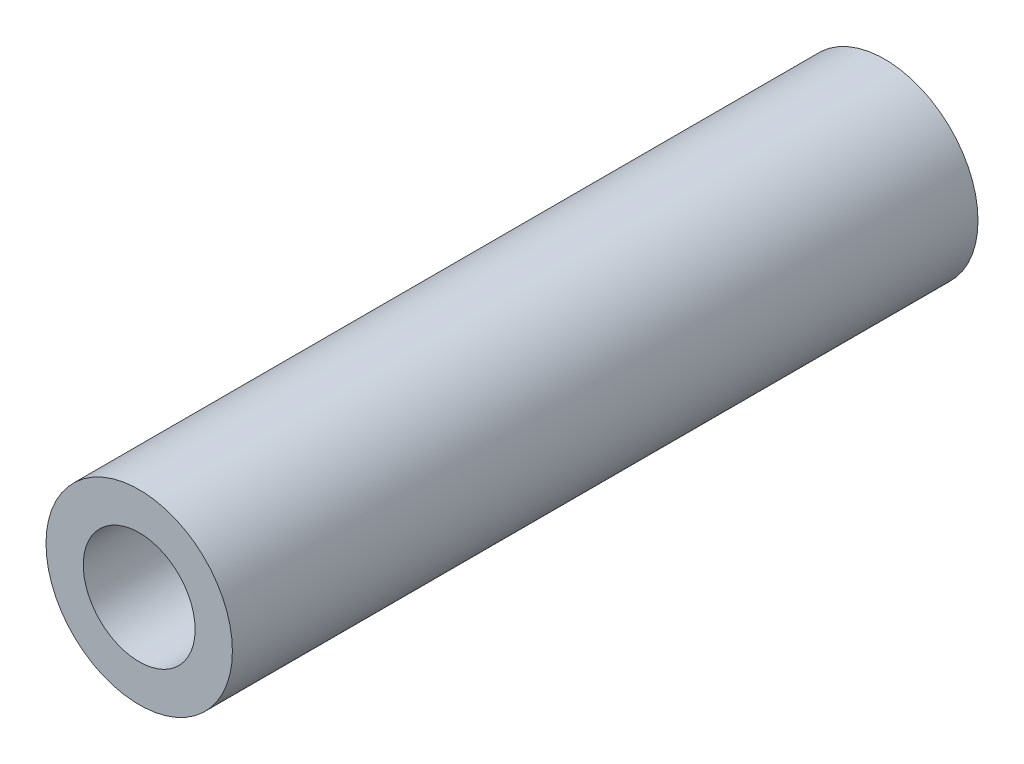
ISO-10303-21;
HEADER;
FILE_DESCRIPTION(('STEP AP214'),'2;1');
FILE_NAME('part.step','',(''),(''),'','','');
FILE_SCHEMA(('AUTOMOTIVE_DESIGN { 1 0 10303 214 1 1 1 1 }'));
ENDSEC;
DATA;
#1=APPLICATION_CONTEXT('core data for automotive mechanical design processes');
#2=APPLICATION_PROTOCOL_DEFINITION('international standard','automotive_design',2000,#1);
#3=PRODUCT_CONTEXT('',#1,'mechanical');
#4=PRODUCT('Part','Part','',(#3));
#5=PRODUCT_RELATED_PRODUCT_CATEGORY('part','',(#4));
#6=PRODUCT_DEFINITION_FORMATION('','',#4);
#7=PRODUCT_DEFINITION_CONTEXT('part definition',#1,'design');
#8=PRODUCT_DEFINITION('design','',#6,#7);
#9=PRODUCT_DEFINITION_SHAPE('','',#8);
#10=(LENGTH_UNIT() NAMED_UNIT(*) SI_UNIT(.MILLI.,.METRE.));
#11=(NAMED_UNIT(*) PLANE_ANGLE_UNIT() SI_UNIT($,.RADIAN.));
#12=(NAMED_UNIT(*) SI_UNIT($,.STERADIAN.) SOLID_ANGLE_UNIT());
#13=UNCERTAINTY_MEASURE_WITH_UNIT(LENGTH_MEASURE(1.E-05),#10,'distance_accuracy_value','');
#14=(GEOMETRIC_REPRESENTATION_CONTEXT(3) GLOBAL_UNCERTAINTY_ASSIGNED_CONTEXT((#13)) GLOBAL_UNIT_ASSIGNED_CONTEXT((#10,
#11,#12)) REPRESENTATION_CONTEXT('',''));
#15=CARTESIAN_POINT('',(0.,0.,0.));
#16=DIRECTION('',(0.,0.,1.));
#17=DIRECTION('',(1.,0.,0.));
#18=AXIS2_PLACEMENT_3D('',#15,#16,#17);
#19=CARTESIAN_POINT('',(0.,0.,20.));
#20=DIRECTION('',(0.,0.,1.));
#21=DIRECTION('',(1.,0.,0.));
#22=AXIS2_PLACEMENT_3D('',#19,#20,#21);
#23=PLANE('',#22);
#24=CARTESIAN_POINT('',(0.,0.,20.));
#25=DIRECTION('',(0.,0.,1.));
#26=DIRECTION('',(1.,0.,0.));
#27=AXIS2_PLACEMENT_3D('',#24,#25,#26);
#28=CIRCLE('',#27,2.5);
#29=CARTESIAN_POINT('',(2.5,0.,20.));
#30=VERTEX_POINT('',#29);
#31=EDGE_CURVE('E10',#30,#30,#28,.T.);
#32=ORIENTED_EDGE('',*,*,#31,.T.);
#33=EDGE_LOOP('',(#32));
#34=FACE_BOUND('',#33,.T.);
#35=CARTESIAN_POINT('',(0.,0.,20.));
#36=DIRECTION('',(0.,0.,1.));
#37=DIRECTION('',(1.,0.,0.));
#38=AXIS2_PLACEMENT_3D('',#35,#36,#37);
#39=CIRCLE('',#38,1.5);
#40=CARTESIAN_POINT('',(1.5,0.,20.));
#41=VERTEX_POINT('',#40);
#42=EDGE_CURVE('E50',#41,#41,#39,.T.);
#43=ORIENTED_EDGE('',*,*,#42,.F.);
#44=EDGE_LOOP('',(#43));
#45=FACE_BOUND('',#44,.T.);
#46=ADVANCED_FACE('F37',(#34,#45),#23,.T.);
#47=CARTESIAN_POINT('',(0.,0.,0.));
#48=DIRECTION('',(0.,0.,1.));
#49=DIRECTION('',(1.,0.,0.));
#50=AXIS2_PLACEMENT_3D('',#47,#48,#49);
#51=PLANE('',#50);
#52=CARTESIAN_POINT('',(0.,0.,0.));
#53=DIRECTION('',(0.,0.,1.));
#54=DIRECTION('',(1.,0.,0.));
#55=AXIS2_PLACEMENT_3D('',#52,#53,#54);
#56=CIRCLE('',#55,2.5);
#57=CARTESIAN_POINT('',(2.5,0.,0.));
#58=VERTEX_POINT('',#57);
#59=EDGE_CURVE('E41',#58,#58,#56,.T.);
#60=ORIENTED_EDGE('',*,*,#59,.F.);
#61=EDGE_LOOP('',(#60));
#62=FACE_BOUND('',#61,.T.);
#63=CARTESIAN_POINT('',(0.,0.,0.));
#64=DIRECTION('',(0.,0.,1.));
#65=DIRECTION('',(1.,0.,0.));
#66=AXIS2_PLACEMENT_3D('',#63,#64,#65);
#67=CIRCLE('',#66,1.5);
#68=CARTESIAN_POINT('',(1.5,0.,0.));
#69=VERTEX_POINT('',#68);
#70=EDGE_CURVE('E52',#69,#69,#67,.T.);
#71=ORIENTED_EDGE('',*,*,#70,.T.);
#72=EDGE_LOOP('',(#71));
#73=FACE_BOUND('',#72,.T.);
#74=ADVANCED_FACE('F64',(#62,#73),#51,.F.);
#75=CARTESIAN_POINT('',(0.,0.,20.));
#76=DIRECTION('',(0.,0.,-1.));
#77=DIRECTION('',(-1.,0.,0.));
#78=AXIS2_PLACEMENT_3D('',#75,#76,#77);
#79=CYLINDRICAL_SURFACE('',#78,2.5);
#80=ORIENTED_EDGE('',*,*,#31,.F.);
#81=EDGE_LOOP('',(#80));
#82=FACE_BOUND('',#81,.T.);
#83=ORIENTED_EDGE('',*,*,#59,.T.);
#84=EDGE_LOOP('',(#83));
#85=FACE_BOUND('',#84,.T.);
#86=ADVANCED_FACE('F39',(#82,#85),#79,.T.);
#87=CARTESIAN_POINT('',(0.,0.,20.));
#88=DIRECTION('',(0.,0.,-1.));
#89=DIRECTION('',(-1.,0.,0.));
#90=AXIS2_PLACEMENT_3D('',#87,#88,#89);
#91=CYLINDRICAL_SURFACE('',#90,1.5);
#92=ORIENTED_EDGE('',*,*,#42,.T.);
#93=EDGE_LOOP('',(#92));
#94=FACE_BOUND('',#93,.T.);
#95=ORIENTED_EDGE('',*,*,#70,.F.);
#96=EDGE_LOOP('',(#95));
#97=FACE_BOUND('',#96,.T.);
#98=ADVANCED_FACE('F60',(#94,#97),#91,.F.);
#99=CLOSED_SHELL('',(#46,#74,#86,#98));
#100=MANIFOLD_SOLID_BREP('B2',#99);
#101=ADVANCED_BREP_SHAPE_REPRESENTATION('',(#18,#100),#14);
#102=SHAPE_DEFINITION_REPRESENTATION(#9,#101);
ENDSEC;
END-ISO-10303-21;
